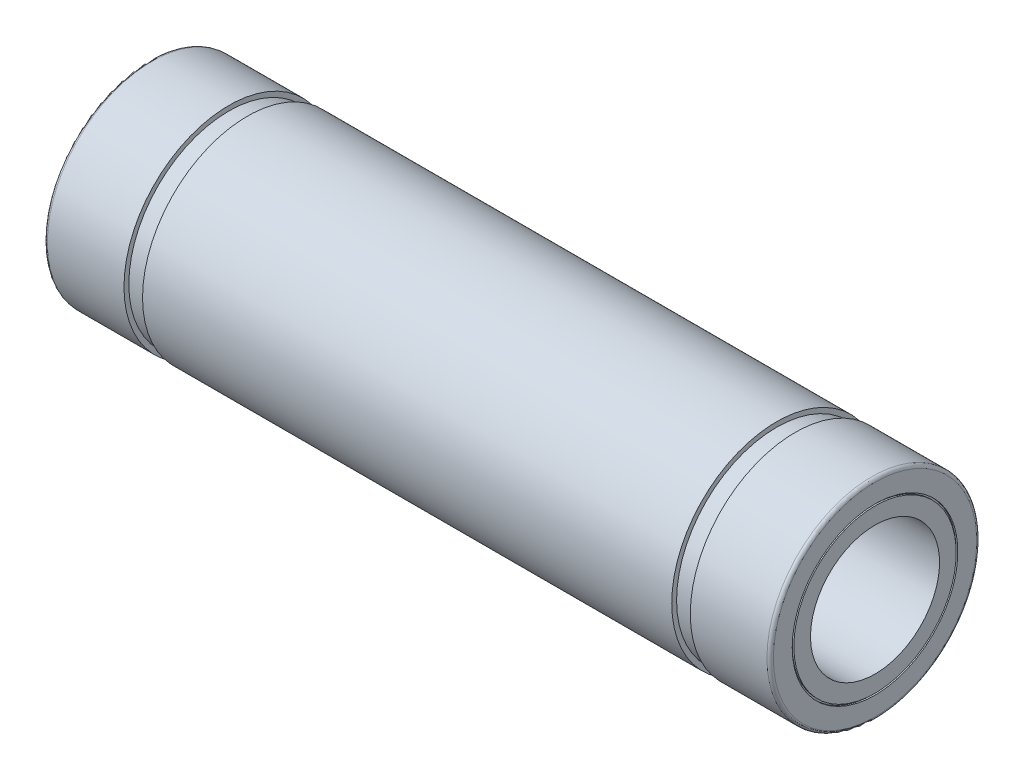
ISO-10303-21;
HEADER;
FILE_DESCRIPTION(('STEP AP214'),'2;1');
FILE_NAME('part.step','',(''),(''),'','','');
FILE_SCHEMA(('AUTOMOTIVE_DESIGN { 1 0 10303 214 1 1 1 1 }'));
ENDSEC;
DATA;
#1=APPLICATION_CONTEXT('core data for automotive mechanical design processes');
#2=APPLICATION_PROTOCOL_DEFINITION('international standard','automotive_design',2000,#1);
#3=PRODUCT_CONTEXT('',#1,'mechanical');
#4=PRODUCT('Part','Part','',(#3));
#5=PRODUCT_RELATED_PRODUCT_CATEGORY('part','',(#4));
#6=PRODUCT_DEFINITION_FORMATION('','',#4);
#7=PRODUCT_DEFINITION_CONTEXT('part definition',#1,'design');
#8=PRODUCT_DEFINITION('design','',#6,#7);
#9=PRODUCT_DEFINITION_SHAPE('','',#8);
#10=(LENGTH_UNIT() NAMED_UNIT(*) SI_UNIT(.MILLI.,.METRE.));
#11=(NAMED_UNIT(*) PLANE_ANGLE_UNIT() SI_UNIT($,.RADIAN.));
#12=(NAMED_UNIT(*) SI_UNIT($,.STERADIAN.) SOLID_ANGLE_UNIT());
#13=UNCERTAINTY_MEASURE_WITH_UNIT(LENGTH_MEASURE(1.E-05),#10,'distance_accuracy_value','');
#14=(GEOMETRIC_REPRESENTATION_CONTEXT(3) GLOBAL_UNCERTAINTY_ASSIGNED_CONTEXT((#13)) GLOBAL_UNIT_ASSIGNED_CONTEXT((#10,
#11,#12)) REPRESENTATION_CONTEXT('',''));
#15=CARTESIAN_POINT('',(0.,0.,0.));
#16=DIRECTION('',(0.,0.,1.));
#17=DIRECTION('',(1.,0.,0.));
#18=AXIS2_PLACEMENT_3D('',#15,#16,#17);
#19=CARTESIAN_POINT('',(22.4,5.1333333333,0.));
#20=DIRECTION('',(1.,0.,0.));
#21=DIRECTION('',(0.,0.,-1.));
#22=AXIS2_PLACEMENT_3D('',#19,#20,#21);
#23=PLANE('',#22);
#24=CARTESIAN_POINT('',(22.4,0.,0.));
#25=DIRECTION('',(-1.,0.,0.));
#26=DIRECTION('',(0.,0.,1.));
#27=AXIS2_PLACEMENT_3D('',#24,#25,#26);
#28=CIRCLE('',#27,5.0333333333);
#29=CARTESIAN_POINT('',(22.4,0.,5.0333333333));
#30=VERTEX_POINT('',#29);
#31=EDGE_CURVE('E10',#30,#30,#28,.T.);
#32=ORIENTED_EDGE('',*,*,#31,.T.);
#33=EDGE_LOOP('',(#32));
#34=FACE_BOUND('',#33,.T.);
#35=CARTESIAN_POINT('',(22.4,0.,0.));
#36=DIRECTION('',(-1.,0.,0.));
#37=DIRECTION('',(0.,0.,1.));
#38=AXIS2_PLACEMENT_3D('',#35,#36,#37);
#39=CIRCLE('',#38,5.1333333333);
#40=CARTESIAN_POINT('',(22.4,0.,5.1333333333));
#41=VERTEX_POINT('',#40);
#42=EDGE_CURVE('E101',#41,#41,#39,.T.);
#43=ORIENTED_EDGE('',*,*,#42,.F.);
#44=EDGE_LOOP('',(#43));
#45=FACE_BOUND('',#44,.T.);
#46=ADVANCED_FACE('F31',(#34,#45),#23,.T.);
#47=CARTESIAN_POINT('',(22.5,0.,0.));
#48=DIRECTION('',(-1.,0.,0.));
#49=DIRECTION('',(0.,0.,1.));
#50=AXIS2_PLACEMENT_3D('',#47,#48,#49);
#51=CYLINDRICAL_SURFACE('',#50,5.0333333333);
#52=CARTESIAN_POINT('',(22.5,0.,0.));
#53=DIRECTION('',(-1.,0.,0.));
#54=DIRECTION('',(0.,0.,1.));
#55=AXIS2_PLACEMENT_3D('',#52,#53,#54);
#56=CIRCLE('',#55,5.0333333333);
#57=CARTESIAN_POINT('',(22.5,0.,5.0333333333));
#58=VERTEX_POINT('',#57);
#59=EDGE_CURVE('E37',#58,#58,#56,.T.);
#60=ORIENTED_EDGE('',*,*,#59,.T.);
#61=EDGE_LOOP('',(#60));
#62=FACE_BOUND('',#61,.T.);
#63=ORIENTED_EDGE('',*,*,#31,.F.);
#64=EDGE_LOOP('',(#63));
#65=FACE_BOUND('',#64,.T.);
#66=ADVANCED_FACE('F109',(#62,#65),#51,.T.);
#67=CARTESIAN_POINT('',(22.5,5.0333333333,0.));
#68=DIRECTION('',(1.,0.,0.));
#69=DIRECTION('',(0.,0.,-1.));
#70=AXIS2_PLACEMENT_3D('',#67,#68,#69);
#71=PLANE('',#70);
#72=CARTESIAN_POINT('',(22.5,0.,0.));
#73=DIRECTION('',(-1.,0.,0.));
#74=DIRECTION('',(0.,0.,1.));
#75=AXIS2_PLACEMENT_3D('',#72,#73,#74);
#76=CIRCLE('',#75,4.);
#77=CARTESIAN_POINT('',(22.5,0.,4.));
#78=VERTEX_POINT('',#77);
#79=EDGE_CURVE('E41',#78,#78,#76,.T.);
#80=ORIENTED_EDGE('',*,*,#79,.T.);
#81=EDGE_LOOP('',(#80));
#82=FACE_BOUND('',#81,.T.);
#83=ORIENTED_EDGE('',*,*,#59,.F.);
#84=EDGE_LOOP('',(#83));
#85=FACE_BOUND('',#84,.T.);
#86=ADVANCED_FACE('F113',(#82,#85),#71,.T.);
#87=CARTESIAN_POINT('',(22.5,0.,0.));
#88=DIRECTION('',(-1.,0.,0.));
#89=DIRECTION('',(0.,0.,1.));
#90=AXIS2_PLACEMENT_3D('',#87,#88,#89);
#91=CYLINDRICAL_SURFACE('',#90,4.);
#92=CARTESIAN_POINT('',(-22.5,0.,0.));
#93=DIRECTION('',(-1.,0.,0.));
#94=DIRECTION('',(0.,0.,1.));
#95=AXIS2_PLACEMENT_3D('',#92,#93,#94);
#96=CIRCLE('',#95,4.);
#97=CARTESIAN_POINT('',(-22.5,0.,4.));
#98=VERTEX_POINT('',#97);
#99=EDGE_CURVE('E45',#98,#98,#96,.T.);
#100=ORIENTED_EDGE('',*,*,#99,.T.);
#101=EDGE_LOOP('',(#100));
#102=FACE_BOUND('',#101,.T.);
#103=ORIENTED_EDGE('',*,*,#79,.F.);
#104=EDGE_LOOP('',(#103));
#105=FACE_BOUND('',#104,.T.);
#106=ADVANCED_FACE('F117',(#102,#105),#91,.F.);
#107=CARTESIAN_POINT('',(-22.5,4.,0.));
#108=DIRECTION('',(-1.,0.,0.));
#109=DIRECTION('',(0.,0.,1.));
#110=AXIS2_PLACEMENT_3D('',#107,#108,#109);
#111=PLANE('',#110);
#112=CARTESIAN_POINT('',(-22.5,0.,0.));
#113=DIRECTION('',(-1.,0.,0.));
#114=DIRECTION('',(0.,0.,1.));
#115=AXIS2_PLACEMENT_3D('',#112,#113,#114);
#116=CIRCLE('',#115,5.0333333333);
#117=CARTESIAN_POINT('',(-22.5,0.,5.0333333333));
#118=VERTEX_POINT('',#117);
#119=EDGE_CURVE('E50',#118,#118,#116,.T.);
#120=ORIENTED_EDGE('',*,*,#119,.T.);
#121=EDGE_LOOP('',(#120));
#122=FACE_BOUND('',#121,.T.);
#123=ORIENTED_EDGE('',*,*,#99,.F.);
#124=EDGE_LOOP('',(#123));
#125=FACE_BOUND('',#124,.T.);
#126=ADVANCED_FACE('F124',(#122,#125),#111,.T.);
#127=CARTESIAN_POINT('',(22.5,0.,0.));
#128=DIRECTION('',(-1.,0.,0.));
#129=DIRECTION('',(0.,0.,1.));
#130=AXIS2_PLACEMENT_3D('',#127,#128,#129);
#131=CYLINDRICAL_SURFACE('',#130,5.0333333333);
#132=CARTESIAN_POINT('',(-22.4,0.,0.));
#133=DIRECTION('',(-1.,0.,0.));
#134=DIRECTION('',(0.,0.,1.));
#135=AXIS2_PLACEMENT_3D('',#132,#133,#134);
#136=CIRCLE('',#135,5.0333333333);
#137=CARTESIAN_POINT('',(-22.4,0.,5.0333333333));
#138=VERTEX_POINT('',#137);
#139=EDGE_CURVE('E53',#138,#138,#136,.T.);
#140=ORIENTED_EDGE('',*,*,#139,.T.);
#141=EDGE_LOOP('',(#140));
#142=FACE_BOUND('',#141,.T.);
#143=ORIENTED_EDGE('',*,*,#119,.F.);
#144=EDGE_LOOP('',(#143));
#145=FACE_BOUND('',#144,.T.);
#146=ADVANCED_FACE('F128',(#142,#145),#131,.T.);
#147=CARTESIAN_POINT('',(-22.4,5.0333333333,0.));
#148=DIRECTION('',(-1.,0.,0.));
#149=DIRECTION('',(0.,0.,1.));
#150=AXIS2_PLACEMENT_3D('',#147,#148,#149);
#151=PLANE('',#150);
#152=CARTESIAN_POINT('',(-22.4,0.,0.));
#153=DIRECTION('',(-1.,0.,0.));
#154=DIRECTION('',(0.,0.,1.));
#155=AXIS2_PLACEMENT_3D('',#152,#153,#154);
#156=CIRCLE('',#155,5.1333333333);
#157=CARTESIAN_POINT('',(-22.4,0.,5.1333333333));
#158=VERTEX_POINT('',#157);
#159=EDGE_CURVE('E56',#158,#158,#156,.T.);
#160=ORIENTED_EDGE('',*,*,#159,.T.);
#161=EDGE_LOOP('',(#160));
#162=FACE_BOUND('',#161,.T.);
#163=ORIENTED_EDGE('',*,*,#139,.F.);
#164=EDGE_LOOP('',(#163));
#165=FACE_BOUND('',#164,.T.);
#166=ADVANCED_FACE('F132',(#162,#165),#151,.T.);
#167=CARTESIAN_POINT('',(22.5,0.,0.));
#168=DIRECTION('',(-1.,0.,0.));
#169=DIRECTION('',(0.,0.,1.));
#170=AXIS2_PLACEMENT_3D('',#167,#168,#169);
#171=CYLINDRICAL_SURFACE('',#170,5.1333333333);
#172=CARTESIAN_POINT('',(-22.5,0.,0.));
#173=DIRECTION('',(-1.,0.,0.));
#174=DIRECTION('',(0.,0.,1.));
#175=AXIS2_PLACEMENT_3D('',#172,#173,#174);
#176=CIRCLE('',#175,5.1333333333);
#177=CARTESIAN_POINT('',(-22.5,0.,5.1333333333));
#178=VERTEX_POINT('',#177);
#179=EDGE_CURVE('E59',#178,#178,#176,.T.);
#180=ORIENTED_EDGE('',*,*,#179,.T.);
#181=EDGE_LOOP('',(#180));
#182=FACE_BOUND('',#181,.T.);
#183=ORIENTED_EDGE('',*,*,#159,.F.);
#184=EDGE_LOOP('',(#183));
#185=FACE_BOUND('',#184,.T.);
#186=ADVANCED_FACE('F136',(#182,#185),#171,.F.);
#187=CARTESIAN_POINT('',(-22.5,5.1333333333,0.));
#188=DIRECTION('',(-1.,0.,0.));
#189=DIRECTION('',(0.,0.,1.));
#190=AXIS2_PLACEMENT_3D('',#187,#188,#189);
#191=PLANE('',#190);
#192=CARTESIAN_POINT('',(-22.5,0.,0.));
#193=DIRECTION('',(-1.,0.,0.));
#194=DIRECTION('',(0.,0.,1.));
#195=AXIS2_PLACEMENT_3D('',#192,#193,#194);
#196=CIRCLE('',#195,6.3);
#197=CARTESIAN_POINT('',(-22.5,0.,6.3));
#198=VERTEX_POINT('',#197);
#199=EDGE_CURVE('E62',#198,#198,#196,.T.);
#200=ORIENTED_EDGE('',*,*,#199,.T.);
#201=EDGE_LOOP('',(#200));
#202=FACE_BOUND('',#201,.T.);
#203=ORIENTED_EDGE('',*,*,#179,.F.);
#204=EDGE_LOOP('',(#203));
#205=FACE_BOUND('',#204,.T.);
#206=ADVANCED_FACE('F140',(#202,#205),#191,.T.);
#207=CARTESIAN_POINT('',(-22.2999999999995,0.,0.));
#208=DIRECTION('',(-1.,0.,0.));
#209=DIRECTION('',(0.,0.,1.));
#210=AXIS2_PLACEMENT_3D('',#207,#208,#209);
#211=TOROIDAL_SURFACE('',#210,6.3,0.200000000000314);
#212=CARTESIAN_POINT('',(-22.2999999999995,0.,0.));
#213=DIRECTION('',(-1.,0.,0.));
#214=DIRECTION('',(0.,0.,1.));
#215=AXIS2_PLACEMENT_3D('',#212,#213,#214);
#216=CIRCLE('',#215,6.50000000000031);
#217=CARTESIAN_POINT('',(-22.2999999999995,0.,6.50000000000031));
#218=VERTEX_POINT('',#217);
#219=EDGE_CURVE('E65',#218,#218,#216,.T.);
#220=ORIENTED_EDGE('',*,*,#219,.T.);
#221=EDGE_LOOP('',(#220));
#222=FACE_BOUND('',#221,.T.);
#223=ORIENTED_EDGE('',*,*,#199,.F.);
#224=EDGE_LOOP('',(#223));
#225=FACE_BOUND('',#224,.T.);
#226=ADVANCED_FACE('F144',(#222,#225),#211,.T.);
#227=CARTESIAN_POINT('',(22.5,0.,0.));
#228=DIRECTION('',(-1.,0.,0.));
#229=DIRECTION('',(0.,0.,1.));
#230=AXIS2_PLACEMENT_3D('',#227,#228,#229);
#231=CYLINDRICAL_SURFACE('',#230,6.50000000000016);
#232=CARTESIAN_POINT('',(-17.55,0.,0.));
#233=DIRECTION('',(-1.,0.,0.));
#234=DIRECTION('',(0.,0.,1.));
#235=AXIS2_PLACEMENT_3D('',#232,#233,#234);
#236=CIRCLE('',#235,6.5);
#237=CARTESIAN_POINT('',(-17.55,0.,6.5));
#238=VERTEX_POINT('',#237);
#239=EDGE_CURVE('E68',#238,#238,#236,.T.);
#240=ORIENTED_EDGE('',*,*,#239,.T.);
#241=EDGE_LOOP('',(#240));
#242=FACE_BOUND('',#241,.T.);
#243=ORIENTED_EDGE('',*,*,#219,.F.);
#244=EDGE_LOOP('',(#243));
#245=FACE_BOUND('',#244,.T.);
#246=ADVANCED_FACE('F148',(#242,#245),#231,.T.);
#247=CARTESIAN_POINT('',(-17.55,6.5,0.));
#248=DIRECTION('',(1.,0.,0.));
#249=DIRECTION('',(0.,0.,-1.));
#250=AXIS2_PLACEMENT_3D('',#247,#248,#249);
#251=PLANE('',#250);
#252=CARTESIAN_POINT('',(-17.55,0.,0.));
#253=DIRECTION('',(-1.,0.,0.));
#254=DIRECTION('',(0.,0.,1.));
#255=AXIS2_PLACEMENT_3D('',#252,#253,#254);
#256=CIRCLE('',#255,6.2);
#257=CARTESIAN_POINT('',(-17.55,0.,6.2));
#258=VERTEX_POINT('',#257);
#259=EDGE_CURVE('E71',#258,#258,#256,.T.);
#260=ORIENTED_EDGE('',*,*,#259,.T.);
#261=EDGE_LOOP('',(#260));
#262=FACE_BOUND('',#261,.T.);
#263=ORIENTED_EDGE('',*,*,#239,.F.);
#264=EDGE_LOOP('',(#263));
#265=FACE_BOUND('',#264,.T.);
#266=ADVANCED_FACE('F152',(#262,#265),#251,.T.);
#267=CARTESIAN_POINT('',(22.5,0.,0.));
#268=DIRECTION('',(-1.,0.,0.));
#269=DIRECTION('',(0.,0.,1.));
#270=AXIS2_PLACEMENT_3D('',#267,#268,#269);
#271=CYLINDRICAL_SURFACE('',#270,6.2);
#272=CARTESIAN_POINT('',(-16.4,0.,0.));
#273=DIRECTION('',(-1.,0.,0.));
#274=DIRECTION('',(0.,0.,1.));
#275=AXIS2_PLACEMENT_3D('',#272,#273,#274);
#276=CIRCLE('',#275,6.2);
#277=CARTESIAN_POINT('',(-16.4,0.,6.2));
#278=VERTEX_POINT('',#277);
#279=EDGE_CURVE('E74',#278,#278,#276,.T.);
#280=ORIENTED_EDGE('',*,*,#279,.T.);
#281=EDGE_LOOP('',(#280));
#282=FACE_BOUND('',#281,.T.);
#283=ORIENTED_EDGE('',*,*,#259,.F.);
#284=EDGE_LOOP('',(#283));
#285=FACE_BOUND('',#284,.T.);
#286=ADVANCED_FACE('F156',(#282,#285),#271,.T.);
#287=CARTESIAN_POINT('',(-16.4,6.2,0.));
#288=DIRECTION('',(-1.,0.,0.));
#289=DIRECTION('',(0.,0.,1.));
#290=AXIS2_PLACEMENT_3D('',#287,#288,#289);
#291=PLANE('',#290);
#292=CARTESIAN_POINT('',(-16.4,0.,0.));
#293=DIRECTION('',(-1.,0.,0.));
#294=DIRECTION('',(0.,0.,1.));
#295=AXIS2_PLACEMENT_3D('',#292,#293,#294);
#296=CIRCLE('',#295,6.5);
#297=CARTESIAN_POINT('',(-16.4,0.,6.5));
#298=VERTEX_POINT('',#297);
#299=EDGE_CURVE('E77',#298,#298,#296,.T.);
#300=ORIENTED_EDGE('',*,*,#299,.T.);
#301=EDGE_LOOP('',(#300));
#302=FACE_BOUND('',#301,.T.);
#303=ORIENTED_EDGE('',*,*,#279,.F.);
#304=EDGE_LOOP('',(#303));
#305=FACE_BOUND('',#304,.T.);
#306=ADVANCED_FACE('F160',(#302,#305),#291,.T.);
#307=CARTESIAN_POINT('',(22.5,0.,0.));
#308=DIRECTION('',(-1.,0.,0.));
#309=DIRECTION('',(0.,0.,1.));
#310=AXIS2_PLACEMENT_3D('',#307,#308,#309);
#311=CYLINDRICAL_SURFACE('',#310,6.5);
#312=CARTESIAN_POINT('',(16.4,0.,0.));
#313=DIRECTION('',(-1.,0.,0.));
#314=DIRECTION('',(0.,0.,1.));
#315=AXIS2_PLACEMENT_3D('',#312,#313,#314);
#316=CIRCLE('',#315,6.5);
#317=CARTESIAN_POINT('',(16.4,0.,6.5));
#318=VERTEX_POINT('',#317);
#319=EDGE_CURVE('E80',#318,#318,#316,.T.);
#320=ORIENTED_EDGE('',*,*,#319,.T.);
#321=EDGE_LOOP('',(#320));
#322=FACE_BOUND('',#321,.T.);
#323=ORIENTED_EDGE('',*,*,#299,.F.);
#324=EDGE_LOOP('',(#323));
#325=FACE_BOUND('',#324,.T.);
#326=ADVANCED_FACE('F164',(#322,#325),#311,.T.);
#327=CARTESIAN_POINT('',(16.4,6.5,0.));
#328=DIRECTION('',(1.,0.,0.));
#329=DIRECTION('',(0.,0.,-1.));
#330=AXIS2_PLACEMENT_3D('',#327,#328,#329);
#331=PLANE('',#330);
#332=CARTESIAN_POINT('',(16.4,0.,0.));
#333=DIRECTION('',(-1.,0.,0.));
#334=DIRECTION('',(0.,0.,1.));
#335=AXIS2_PLACEMENT_3D('',#332,#333,#334);
#336=CIRCLE('',#335,6.2);
#337=CARTESIAN_POINT('',(16.4,0.,6.2));
#338=VERTEX_POINT('',#337);
#339=EDGE_CURVE('E83',#338,#338,#336,.T.);
#340=ORIENTED_EDGE('',*,*,#339,.T.);
#341=EDGE_LOOP('',(#340));
#342=FACE_BOUND('',#341,.T.);
#343=ORIENTED_EDGE('',*,*,#319,.F.);
#344=EDGE_LOOP('',(#343));
#345=FACE_BOUND('',#344,.T.);
#346=ADVANCED_FACE('F168',(#342,#345),#331,.T.);
#347=CARTESIAN_POINT('',(22.5,0.,0.));
#348=DIRECTION('',(-1.,0.,0.));
#349=DIRECTION('',(0.,0.,1.));
#350=AXIS2_PLACEMENT_3D('',#347,#348,#349);
#351=CYLINDRICAL_SURFACE('',#350,6.2);
#352=CARTESIAN_POINT('',(17.55,0.,0.));
#353=DIRECTION('',(-1.,0.,0.));
#354=DIRECTION('',(0.,0.,1.));
#355=AXIS2_PLACEMENT_3D('',#352,#353,#354);
#356=CIRCLE('',#355,6.2);
#357=CARTESIAN_POINT('',(17.55,0.,6.2));
#358=VERTEX_POINT('',#357);
#359=EDGE_CURVE('E86',#358,#358,#356,.T.);
#360=ORIENTED_EDGE('',*,*,#359,.T.);
#361=EDGE_LOOP('',(#360));
#362=FACE_BOUND('',#361,.T.);
#363=ORIENTED_EDGE('',*,*,#339,.F.);
#364=EDGE_LOOP('',(#363));
#365=FACE_BOUND('',#364,.T.);
#366=ADVANCED_FACE('F172',(#362,#365),#351,.T.);
#367=CARTESIAN_POINT('',(17.55,6.2,0.));
#368=DIRECTION('',(-1.,0.,0.));
#369=DIRECTION('',(0.,0.,1.));
#370=AXIS2_PLACEMENT_3D('',#367,#368,#369);
#371=PLANE('',#370);
#372=CARTESIAN_POINT('',(17.55,0.,0.));
#373=DIRECTION('',(-1.,0.,0.));
#374=DIRECTION('',(0.,0.,1.));
#375=AXIS2_PLACEMENT_3D('',#372,#373,#374);
#376=CIRCLE('',#375,6.5);
#377=CARTESIAN_POINT('',(17.55,0.,6.5));
#378=VERTEX_POINT('',#377);
#379=EDGE_CURVE('E89',#378,#378,#376,.T.);
#380=ORIENTED_EDGE('',*,*,#379,.T.);
#381=EDGE_LOOP('',(#380));
#382=FACE_BOUND('',#381,.T.);
#383=ORIENTED_EDGE('',*,*,#359,.F.);
#384=EDGE_LOOP('',(#383));
#385=FACE_BOUND('',#384,.T.);
#386=ADVANCED_FACE('F176',(#382,#385),#371,.T.);
#387=CARTESIAN_POINT('',(22.5,0.,0.));
#388=DIRECTION('',(-1.,0.,0.));
#389=DIRECTION('',(0.,0.,1.));
#390=AXIS2_PLACEMENT_3D('',#387,#388,#389);
#391=CYLINDRICAL_SURFACE('',#390,6.5);
#392=CARTESIAN_POINT('',(22.3,0.,0.));
#393=DIRECTION('',(-1.,0.,0.));
#394=DIRECTION('',(0.,0.,1.));
#395=AXIS2_PLACEMENT_3D('',#392,#393,#394);
#396=CIRCLE('',#395,6.5);
#397=CARTESIAN_POINT('',(22.3,0.,6.5));
#398=VERTEX_POINT('',#397);
#399=EDGE_CURVE('E92',#398,#398,#396,.T.);
#400=ORIENTED_EDGE('',*,*,#399,.T.);
#401=EDGE_LOOP('',(#400));
#402=FACE_BOUND('',#401,.T.);
#403=ORIENTED_EDGE('',*,*,#379,.F.);
#404=EDGE_LOOP('',(#403));
#405=FACE_BOUND('',#404,.T.);
#406=ADVANCED_FACE('F180',(#402,#405),#391,.T.);
#407=CARTESIAN_POINT('',(22.2999999999995,0.,0.));
#408=DIRECTION('',(-1.,0.,0.));
#409=DIRECTION('',(0.,0.,1.));
#410=AXIS2_PLACEMENT_3D('',#407,#408,#409);
#411=TOROIDAL_SURFACE('',#410,6.3,0.200000000000124);
#412=CARTESIAN_POINT('',(22.4999999999996,0.,0.));
#413=DIRECTION('',(-1.,0.,0.));
#414=DIRECTION('',(0.,0.,1.));
#415=AXIS2_PLACEMENT_3D('',#412,#413,#414);
#416=CIRCLE('',#415,6.3);
#417=CARTESIAN_POINT('',(22.4999999999996,0.,6.3));
#418=VERTEX_POINT('',#417);
#419=EDGE_CURVE('E95',#418,#418,#416,.T.);
#420=ORIENTED_EDGE('',*,*,#419,.T.);
#421=EDGE_LOOP('',(#420));
#422=FACE_BOUND('',#421,.T.);
#423=ORIENTED_EDGE('',*,*,#399,.F.);
#424=EDGE_LOOP('',(#423));
#425=FACE_BOUND('',#424,.T.);
#426=ADVANCED_FACE('F184',(#422,#425),#411,.T.);
#427=CARTESIAN_POINT('',(22.4999999999998,6.3,0.));
#428=DIRECTION('',(1.,0.,0.));
#429=DIRECTION('',(0.,0.,-1.));
#430=AXIS2_PLACEMENT_3D('',#427,#428,#429);
#431=PLANE('',#430);
#432=CARTESIAN_POINT('',(22.5,0.,0.));
#433=DIRECTION('',(-1.,0.,0.));
#434=DIRECTION('',(0.,0.,1.));
#435=AXIS2_PLACEMENT_3D('',#432,#433,#434);
#436=CIRCLE('',#435,5.1333333333);
#437=CARTESIAN_POINT('',(22.5,0.,5.1333333333));
#438=VERTEX_POINT('',#437);
#439=EDGE_CURVE('E98',#438,#438,#436,.T.);
#440=ORIENTED_EDGE('',*,*,#439,.T.);
#441=EDGE_LOOP('',(#440));
#442=FACE_BOUND('',#441,.T.);
#443=ORIENTED_EDGE('',*,*,#419,.F.);
#444=EDGE_LOOP('',(#443));
#445=FACE_BOUND('',#444,.T.);
#446=ADVANCED_FACE('F188',(#442,#445),#431,.T.);
#447=CARTESIAN_POINT('',(22.5,0.,0.));
#448=DIRECTION('',(-1.,0.,0.));
#449=DIRECTION('',(0.,0.,1.));
#450=AXIS2_PLACEMENT_3D('',#447,#448,#449);
#451=CYLINDRICAL_SURFACE('',#450,5.1333333333);
#452=ORIENTED_EDGE('',*,*,#42,.T.);
#453=EDGE_LOOP('',(#452));
#454=FACE_BOUND('',#453,.T.);
#455=ORIENTED_EDGE('',*,*,#439,.F.);
#456=EDGE_LOOP('',(#455));
#457=FACE_BOUND('',#456,.T.);
#458=ADVANCED_FACE('F105',(#454,#457),#451,.F.);
#459=CLOSED_SHELL('',(#46,#66,#86,#106,#126,#146,#166,#186,#206,#226,#246,#266,#286,#306,#326,
#346,#366,#386,#406,#426,#446,#458));
#460=MANIFOLD_SOLID_BREP('B2',#459);
#461=ADVANCED_BREP_SHAPE_REPRESENTATION('',(#18,#460),#14);
#462=SHAPE_DEFINITION_REPRESENTATION(#9,#461);
ENDSEC;
END-ISO-10303-21;
